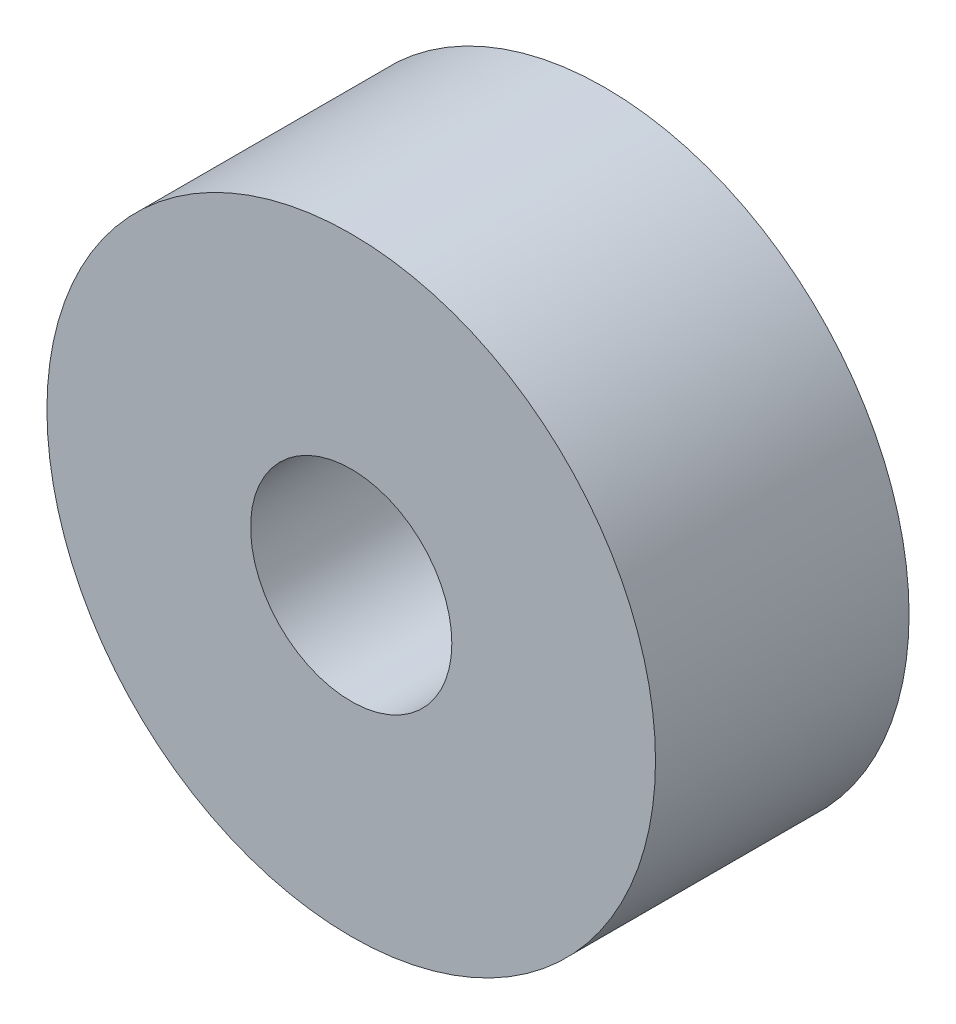
ISO-10303-21;
HEADER;
FILE_DESCRIPTION(('STEP AP214'),'2;1');
FILE_NAME('part.step','',(''),(''),'','','');
FILE_SCHEMA(('AUTOMOTIVE_DESIGN { 1 0 10303 214 1 1 1 1 }'));
ENDSEC;
DATA;
#1=APPLICATION_CONTEXT('core data for automotive mechanical design processes');
#2=APPLICATION_PROTOCOL_DEFINITION('international standard','automotive_design',2000,#1);
#3=PRODUCT_CONTEXT('',#1,'mechanical');
#4=PRODUCT('Part','Part','',(#3));
#5=PRODUCT_RELATED_PRODUCT_CATEGORY('part','',(#4));
#6=PRODUCT_DEFINITION_FORMATION('','',#4);
#7=PRODUCT_DEFINITION_CONTEXT('part definition',#1,'design');
#8=PRODUCT_DEFINITION('design','',#6,#7);
#9=PRODUCT_DEFINITION_SHAPE('','',#8);
#10=(LENGTH_UNIT() NAMED_UNIT(*) SI_UNIT(.MILLI.,.METRE.));
#11=(NAMED_UNIT(*) PLANE_ANGLE_UNIT() SI_UNIT($,.RADIAN.));
#12=(NAMED_UNIT(*) SI_UNIT($,.STERADIAN.) SOLID_ANGLE_UNIT());
#13=UNCERTAINTY_MEASURE_WITH_UNIT(LENGTH_MEASURE(1.E-05),#10,'distance_accuracy_value','');
#14=(GEOMETRIC_REPRESENTATION_CONTEXT(3) GLOBAL_UNCERTAINTY_ASSIGNED_CONTEXT((#13)) GLOBAL_UNIT_ASSIGNED_CONTEXT((#10,
#11,#12)) REPRESENTATION_CONTEXT('',''));
#15=CARTESIAN_POINT('',(0.,0.,0.));
#16=DIRECTION('',(0.,0.,1.));
#17=DIRECTION('',(1.,0.,0.));
#18=AXIS2_PLACEMENT_3D('',#15,#16,#17);
#19=CARTESIAN_POINT('',(0.,0.,4.));
#20=DIRECTION('',(0.,0.,1.));
#21=DIRECTION('',(1.,0.,0.));
#22=AXIS2_PLACEMENT_3D('',#19,#20,#21);
#23=PLANE('',#22);
#24=CARTESIAN_POINT('',(0.,0.,4.));
#25=DIRECTION('',(0.,0.,1.));
#26=DIRECTION('',(1.,0.,0.));
#27=AXIS2_PLACEMENT_3D('',#24,#25,#26);
#28=CIRCLE('',#27,4.8);
#29=CARTESIAN_POINT('',(4.8,0.,4.));
#30=VERTEX_POINT('',#29);
#31=EDGE_CURVE('E10',#30,#30,#28,.T.);
#32=ORIENTED_EDGE('',*,*,#31,.T.);
#33=EDGE_LOOP('',(#32));
#34=FACE_BOUND('',#33,.T.);
#35=CARTESIAN_POINT('',(0.,0.,4.));
#36=DIRECTION('',(0.,0.,1.));
#37=DIRECTION('',(1.,0.,0.));
#38=AXIS2_PLACEMENT_3D('',#35,#36,#37);
#39=CIRCLE('',#38,1.5875);
#40=CARTESIAN_POINT('',(1.5875,0.,4.));
#41=VERTEX_POINT('',#40);
#42=EDGE_CURVE('E40',#41,#41,#39,.T.);
#43=ORIENTED_EDGE('',*,*,#42,.F.);
#44=EDGE_LOOP('',(#43));
#45=FACE_BOUND('',#44,.T.);
#46=ADVANCED_FACE('F29',(#34,#45),#23,.T.);
#47=CARTESIAN_POINT('',(0.,0.,0.));
#48=DIRECTION('',(0.,0.,1.));
#49=DIRECTION('',(1.,0.,0.));
#50=AXIS2_PLACEMENT_3D('',#47,#48,#49);
#51=PLANE('',#50);
#52=CARTESIAN_POINT('',(0.,0.,0.));
#53=DIRECTION('',(0.,0.,1.));
#54=DIRECTION('',(1.,0.,0.));
#55=AXIS2_PLACEMENT_3D('',#52,#53,#54);
#56=CIRCLE('',#55,4.8);
#57=CARTESIAN_POINT('',(4.8,0.,0.));
#58=VERTEX_POINT('',#57);
#59=EDGE_CURVE('E33',#58,#58,#56,.T.);
#60=ORIENTED_EDGE('',*,*,#59,.F.);
#61=EDGE_LOOP('',(#60));
#62=FACE_BOUND('',#61,.T.);
#63=CARTESIAN_POINT('',(0.,0.,0.));
#64=DIRECTION('',(0.,0.,1.));
#65=DIRECTION('',(1.,0.,0.));
#66=AXIS2_PLACEMENT_3D('',#63,#64,#65);
#67=CIRCLE('',#66,1.5875);
#68=CARTESIAN_POINT('',(1.5875,0.,0.));
#69=VERTEX_POINT('',#68);
#70=EDGE_CURVE('E42',#69,#69,#67,.T.);
#71=ORIENTED_EDGE('',*,*,#70,.T.);
#72=EDGE_LOOP('',(#71));
#73=FACE_BOUND('',#72,.T.);
#74=ADVANCED_FACE('F52',(#62,#73),#51,.F.);
#75=CARTESIAN_POINT('',(0.,0.,4.));
#76=DIRECTION('',(0.,0.,-1.));
#77=DIRECTION('',(-1.,0.,0.));
#78=AXIS2_PLACEMENT_3D('',#75,#76,#77);
#79=CYLINDRICAL_SURFACE('',#78,4.8);
#80=ORIENTED_EDGE('',*,*,#31,.F.);
#81=EDGE_LOOP('',(#80));
#82=FACE_BOUND('',#81,.T.);
#83=ORIENTED_EDGE('',*,*,#59,.T.);
#84=EDGE_LOOP('',(#83));
#85=FACE_BOUND('',#84,.T.);
#86=ADVANCED_FACE('F31',(#82,#85),#79,.T.);
#87=CARTESIAN_POINT('',(0.,0.,4.));
#88=DIRECTION('',(0.,0.,-1.));
#89=DIRECTION('',(-1.,0.,0.));
#90=AXIS2_PLACEMENT_3D('',#87,#88,#89);
#91=CYLINDRICAL_SURFACE('',#90,1.5875);
#92=ORIENTED_EDGE('',*,*,#42,.T.);
#93=EDGE_LOOP('',(#92));
#94=FACE_BOUND('',#93,.T.);
#95=ORIENTED_EDGE('',*,*,#70,.F.);
#96=EDGE_LOOP('',(#95));
#97=FACE_BOUND('',#96,.T.);
#98=ADVANCED_FACE('F48',(#94,#97),#91,.F.);
#99=CLOSED_SHELL('',(#46,#74,#86,#98));
#100=MANIFOLD_SOLID_BREP('B2',#99);
#101=ADVANCED_BREP_SHAPE_REPRESENTATION('',(#18,#100),#14);
#102=SHAPE_DEFINITION_REPRESENTATION(#9,#101);
ENDSEC;
END-ISO-10303-21;
